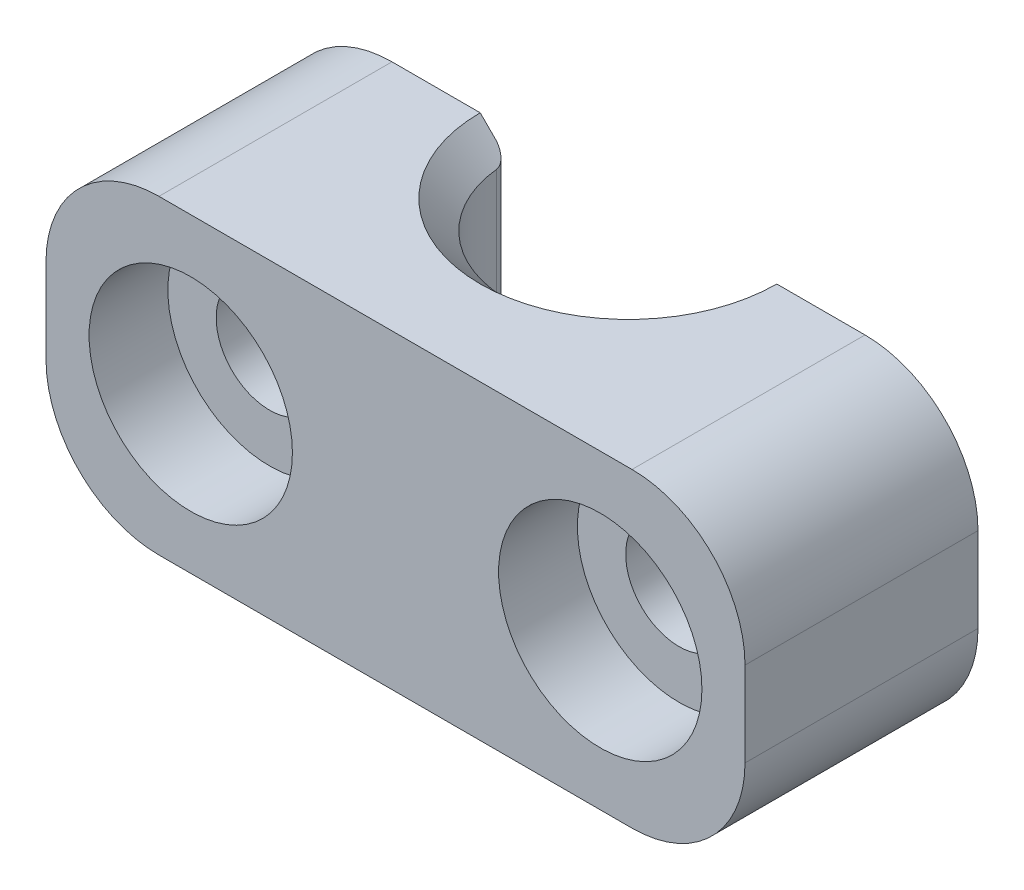
ISO-10303-21;
HEADER;
FILE_DESCRIPTION(('STEP AP214'),'2;1');
FILE_NAME('part.step','',(''),(''),'','','');
FILE_SCHEMA(('AUTOMOTIVE_DESIGN { 1 0 10303 214 1 1 1 1 }'));
ENDSEC;
DATA;
#1=APPLICATION_CONTEXT('core data for automotive mechanical design processes');
#2=APPLICATION_PROTOCOL_DEFINITION('international standard','automotive_design',2000,#1);
#3=PRODUCT_CONTEXT('',#1,'mechanical');
#4=PRODUCT('Part','Part','',(#3));
#5=PRODUCT_RELATED_PRODUCT_CATEGORY('part','',(#4));
#6=PRODUCT_DEFINITION_FORMATION('','',#4);
#7=PRODUCT_DEFINITION_CONTEXT('part definition',#1,'design');
#8=PRODUCT_DEFINITION('design','',#6,#7);
#9=PRODUCT_DEFINITION_SHAPE('','',#8);
#10=(LENGTH_UNIT() NAMED_UNIT(*) SI_UNIT(.MILLI.,.METRE.));
#11=(NAMED_UNIT(*) PLANE_ANGLE_UNIT() SI_UNIT($,.RADIAN.));
#12=(NAMED_UNIT(*) SI_UNIT($,.STERADIAN.) SOLID_ANGLE_UNIT());
#13=UNCERTAINTY_MEASURE_WITH_UNIT(LENGTH_MEASURE(1.E-05),#10,'distance_accuracy_value','');
#14=(GEOMETRIC_REPRESENTATION_CONTEXT(3) GLOBAL_UNCERTAINTY_ASSIGNED_CONTEXT((#13)) GLOBAL_UNIT_ASSIGNED_CONTEXT((#10,
#11,#12)) REPRESENTATION_CONTEXT('',''));
#15=CARTESIAN_POINT('',(0.,0.,0.));
#16=DIRECTION('',(0.,0.,1.));
#17=DIRECTION('',(1.,0.,0.));
#18=AXIS2_PLACEMENT_3D('',#15,#16,#17);
#19=CARTESIAN_POINT('',(0.,0.,0.));
#20=DIRECTION('',(0.,0.,-1.));
#21=DIRECTION('',(-1.,0.,0.));
#22=AXIS2_PLACEMENT_3D('',#19,#20,#21);
#23=PLANE('',#22);
#24=DIRECTION('',(-1.,0.,0.));
#25=VECTOR('',#24,1.);
#26=CARTESIAN_POINT('',(12.375,-5.50000000000001,0.));
#27=LINE('',#26,#25);
#28=CARTESIAN_POINT('',(-5.25000000003318,-5.50000000000001,0.));
#29=VERTEX_POINT('',#28);
#30=CARTESIAN_POINT('',(-8.375,-5.50000000000001,0.));
#31=VERTEX_POINT('',#30);
#32=EDGE_CURVE('E159',#29,#31,#27,.T.);
#33=ORIENTED_EDGE('',*,*,#32,.T.);
#34=CARTESIAN_POINT('',(-8.375,-1.50000000000001,0.));
#35=DIRECTION('',(0.,0.,-1.));
#36=DIRECTION('',(-1.,0.,0.));
#37=AXIS2_PLACEMENT_3D('',#34,#35,#36);
#38=CIRCLE('',#37,4.);
#39=CARTESIAN_POINT('',(-12.375,-1.50000000000001,0.));
#40=VERTEX_POINT('',#39);
#41=EDGE_CURVE('E362',#31,#40,#38,.T.);
#42=ORIENTED_EDGE('',*,*,#41,.T.);
#43=DIRECTION('',(0.,1.,0.));
#44=VECTOR('',#43,1.);
#45=CARTESIAN_POINT('',(-12.375,-5.50000000000001,0.));
#46=LINE('',#45,#44);
#47=CARTESIAN_POINT('',(-12.375,1.5,0.));
#48=VERTEX_POINT('',#47);
#49=EDGE_CURVE('E158',#40,#48,#46,.T.);
#50=ORIENTED_EDGE('',*,*,#49,.T.);
#51=CARTESIAN_POINT('',(-8.375,1.5,0.));
#52=DIRECTION('',(0.,0.,-1.));
#53=DIRECTION('',(-1.,0.,0.));
#54=AXIS2_PLACEMENT_3D('',#51,#52,#53);
#55=CIRCLE('',#54,4.);
#56=CARTESIAN_POINT('',(-8.375,5.5,0.));
#57=VERTEX_POINT('',#56);
#58=EDGE_CURVE('E61',#48,#57,#55,.T.);
#59=ORIENTED_EDGE('',*,*,#58,.T.);
#60=DIRECTION('',(1.,0.,0.));
#61=VECTOR('',#60,1.);
#62=CARTESIAN_POINT('',(-12.375,5.50000000000001,0.));
#63=LINE('',#62,#61);
#64=CARTESIAN_POINT('',(-5.2500000000332,5.5,0.));
#65=VERTEX_POINT('',#64);
#66=EDGE_CURVE('E327',#57,#65,#63,.T.);
#67=ORIENTED_EDGE('',*,*,#66,.T.);
#68=DIRECTION('',(-0.707106781186549,0.707106781186546,0.));
#69=VECTOR('',#68,1.);
#70=CARTESIAN_POINT('',(0.,0.249999999966837,0.));
#71=LINE('',#70,#69);
#72=CARTESIAN_POINT('',(-4.72361090692279,4.9736109068896,0.));
#73=VERTEX_POINT('',#72);
#74=EDGE_CURVE('E188',#65,#73,#71,.F.);
#75=ORIENTED_EDGE('',*,*,#74,.T.);
#76=DIRECTION('',(0.,-1.,0.));
#77=VECTOR('',#76,1.);
#78=CARTESIAN_POINT('',(-4.72361090692279,-4.49999999996681,0.));
#79=LINE('',#78,#77);
#80=CARTESIAN_POINT('',(-4.72361090692279,-4.97361090688961,0.));
#81=VERTEX_POINT('',#80);
#82=EDGE_CURVE('E234',#73,#81,#79,.T.);
#83=ORIENTED_EDGE('',*,*,#82,.T.);
#84=DIRECTION('',(0.707106781186546,0.707106781186549,0.));
#85=VECTOR('',#84,1.);
#86=CARTESIAN_POINT('',(0.,-0.249999999966797,0.));
#87=LINE('',#86,#85);
#88=EDGE_CURVE('E191',#81,#29,#87,.F.);
#89=ORIENTED_EDGE('',*,*,#88,.T.);
#90=EDGE_LOOP('',(#33,#42,#50,#59,#67,#75,#83,#89));
#91=FACE_BOUND('',#90,.T.);
#92=CARTESIAN_POINT('',(-7.25,0.,0.));
#93=DIRECTION('',(0.,0.,1.));
#94=DIRECTION('',(1.,0.,0.));
#95=AXIS2_PLACEMENT_3D('',#92,#93,#94);
#96=CIRCLE('',#95,1.89000000000001);
#97=CARTESIAN_POINT('',(-5.35999999999999,0.,0.));
#98=VERTEX_POINT('',#97);
#99=EDGE_CURVE('E298',#98,#98,#96,.T.);
#100=ORIENTED_EDGE('',*,*,#99,.T.);
#101=EDGE_LOOP('',(#100));
#102=FACE_BOUND('',#101,.T.);
#103=ADVANCED_FACE('F46',(#91,#102),#23,.T.);
#104=CARTESIAN_POINT('',(-12.375,5.50000000000001,8.25));
#105=DIRECTION('',(0.,1.,0.));
#106=DIRECTION('',(-1.,0.,0.));
#107=AXIS2_PLACEMENT_3D('',#104,#105,#106);
#108=PLANE('',#107);
#109=DIRECTION('',(1.,0.,0.));
#110=VECTOR('',#109,1.);
#111=CARTESIAN_POINT('',(-12.375,5.50000000000001,8.25));
#112=LINE('',#111,#110);
#113=CARTESIAN_POINT('',(-8.375,5.5,8.25));
#114=VERTEX_POINT('',#113);
#115=CARTESIAN_POINT('',(8.375,5.5,8.25));
#116=VERTEX_POINT('',#115);
#117=EDGE_CURVE('E319',#114,#116,#112,.T.);
#118=ORIENTED_EDGE('',*,*,#117,.T.);
#119=DIRECTION('',(0.,0.,-1.));
#120=VECTOR('',#119,1.);
#121=CARTESIAN_POINT('',(8.375,5.5,8.25));
#122=LINE('',#121,#120);
#123=CARTESIAN_POINT('',(8.375,5.5,0.));
#124=VERTEX_POINT('',#123);
#125=EDGE_CURVE('E13',#116,#124,#122,.T.);
#126=ORIENTED_EDGE('',*,*,#125,.T.);
#127=CARTESIAN_POINT('',(5.25000000003319,5.5,0.));
#128=VERTEX_POINT('',#127);
#129=EDGE_CURVE('E318',#128,#124,#63,.T.);
#130=ORIENTED_EDGE('',*,*,#129,.F.);
#131=CARTESIAN_POINT('',(0.,5.5,0.));
#132=DIRECTION('',(0.,1.,0.));
#133=DIRECTION('',(-1.,0.,0.));
#134=AXIS2_PLACEMENT_3D('',#131,#132,#133);
#135=CIRCLE('',#134,5.25000000003319);
#136=EDGE_CURVE('E193',#128,#65,#135,.F.);
#137=ORIENTED_EDGE('',*,*,#136,.T.);
#138=ORIENTED_EDGE('',*,*,#66,.F.);
#139=DIRECTION('',(0.,0.,-1.));
#140=VECTOR('',#139,1.);
#141=CARTESIAN_POINT('',(-8.375,5.5,8.25));
#142=LINE('',#141,#140);
#143=EDGE_CURVE('E54',#57,#114,#142,.F.);
#144=ORIENTED_EDGE('',*,*,#143,.T.);
#145=EDGE_LOOP('',(#118,#126,#130,#137,#138,#144));
#146=FACE_BOUND('',#145,.T.);
#147=ADVANCED_FACE('F243',(#146),#108,.T.);
#148=CARTESIAN_POINT('',(-12.375,-5.50000000000001,8.25));
#149=DIRECTION('',(-1.,0.,0.));
#150=DIRECTION('',(0.,0.,1.));
#151=AXIS2_PLACEMENT_3D('',#148,#149,#150);
#152=PLANE('',#151);
#153=ORIENTED_EDGE('',*,*,#49,.F.);
#154=DIRECTION('',(0.,0.,-1.));
#155=VECTOR('',#154,1.);
#156=CARTESIAN_POINT('',(-12.375,-1.50000000000001,8.25));
#157=LINE('',#156,#155);
#158=CARTESIAN_POINT('',(-12.375,-1.50000000000001,8.25));
#159=VERTEX_POINT('',#158);
#160=EDGE_CURVE('E366',#40,#159,#157,.F.);
#161=ORIENTED_EDGE('',*,*,#160,.T.);
#162=DIRECTION('',(0.,1.,0.));
#163=VECTOR('',#162,1.);
#164=CARTESIAN_POINT('',(-12.375,-5.50000000000001,8.25));
#165=LINE('',#164,#163);
#166=CARTESIAN_POINT('',(-12.375,1.5,8.25));
#167=VERTEX_POINT('',#166);
#168=EDGE_CURVE('E175',#159,#167,#165,.T.);
#169=ORIENTED_EDGE('',*,*,#168,.T.);
#170=DIRECTION('',(0.,0.,-1.));
#171=VECTOR('',#170,1.);
#172=CARTESIAN_POINT('',(-12.375,1.5,8.25));
#173=LINE('',#172,#171);
#174=EDGE_CURVE('E364',#167,#48,#173,.T.);
#175=ORIENTED_EDGE('',*,*,#174,.T.);
#176=EDGE_LOOP('',(#153,#161,#169,#175));
#177=FACE_BOUND('',#176,.T.);
#178=ADVANCED_FACE('F247',(#177),#152,.T.);
#179=CARTESIAN_POINT('',(12.375,-5.50000000000001,8.25));
#180=DIRECTION('',(0.,-1.,0.));
#181=DIRECTION('',(1.,0.,0.));
#182=AXIS2_PLACEMENT_3D('',#179,#180,#181);
#183=PLANE('',#182);
#184=CARTESIAN_POINT('',(8.375,-5.50000000000001,0.));
#185=VERTEX_POINT('',#184);
#186=CARTESIAN_POINT('',(5.25000000003318,-5.50000000000001,0.));
#187=VERTEX_POINT('',#186);
#188=EDGE_CURVE('E147',#185,#187,#27,.T.);
#189=ORIENTED_EDGE('',*,*,#188,.F.);
#190=DIRECTION('',(0.,0.,-1.));
#191=VECTOR('',#190,1.);
#192=CARTESIAN_POINT('',(8.375,-5.50000000000001,8.25));
#193=LINE('',#192,#191);
#194=CARTESIAN_POINT('',(8.375,-5.50000000000001,8.25));
#195=VERTEX_POINT('',#194);
#196=EDGE_CURVE('E352',#185,#195,#193,.F.);
#197=ORIENTED_EDGE('',*,*,#196,.T.);
#198=DIRECTION('',(-1.,0.,0.));
#199=VECTOR('',#198,1.);
#200=CARTESIAN_POINT('',(12.375,-5.50000000000001,8.25));
#201=LINE('',#200,#199);
#202=CARTESIAN_POINT('',(-8.375,-5.50000000000001,8.25));
#203=VERTEX_POINT('',#202);
#204=EDGE_CURVE('E179',#195,#203,#201,.T.);
#205=ORIENTED_EDGE('',*,*,#204,.T.);
#206=DIRECTION('',(0.,0.,-1.));
#207=VECTOR('',#206,1.);
#208=CARTESIAN_POINT('',(-8.375,-5.50000000000001,8.25));
#209=LINE('',#208,#207);
#210=EDGE_CURVE('E350',#203,#31,#209,.T.);
#211=ORIENTED_EDGE('',*,*,#210,.T.);
#212=ORIENTED_EDGE('',*,*,#32,.F.);
#213=CARTESIAN_POINT('',(0.,-5.50000000000001,0.));
#214=DIRECTION('',(0.,-1.,0.));
#215=DIRECTION('',(1.,0.,0.));
#216=AXIS2_PLACEMENT_3D('',#213,#214,#215);
#217=CIRCLE('',#216,5.25000000003318);
#218=EDGE_CURVE('E165',#29,#187,#217,.F.);
#219=ORIENTED_EDGE('',*,*,#218,.T.);
#220=EDGE_LOOP('',(#189,#197,#205,#211,#212,#219));
#221=FACE_BOUND('',#220,.T.);
#222=ADVANCED_FACE('F172',(#221),#183,.T.);
#223=CARTESIAN_POINT('',(12.375,5.5,8.25));
#224=DIRECTION('',(1.,0.,0.));
#225=DIRECTION('',(0.,0.,-1.));
#226=AXIS2_PLACEMENT_3D('',#223,#224,#225);
#227=PLANE('',#226);
#228=DIRECTION('',(0.,-1.,0.));
#229=VECTOR('',#228,1.);
#230=CARTESIAN_POINT('',(12.375,5.5,8.25));
#231=LINE('',#230,#229);
#232=CARTESIAN_POINT('',(12.375,1.5,8.25));
#233=VERTEX_POINT('',#232);
#234=CARTESIAN_POINT('',(12.375,-1.50000000000001,8.25));
#235=VERTEX_POINT('',#234);
#236=EDGE_CURVE('E322',#233,#235,#231,.T.);
#237=ORIENTED_EDGE('',*,*,#236,.T.);
#238=DIRECTION('',(0.,0.,-1.));
#239=VECTOR('',#238,1.);
#240=CARTESIAN_POINT('',(12.375,-1.50000000000001,8.25));
#241=LINE('',#240,#239);
#242=CARTESIAN_POINT('',(12.375,-1.50000000000001,0.));
#243=VERTEX_POINT('',#242);
#244=EDGE_CURVE('E338',#235,#243,#241,.T.);
#245=ORIENTED_EDGE('',*,*,#244,.T.);
#246=DIRECTION('',(0.,-1.,0.));
#247=VECTOR('',#246,1.);
#248=CARTESIAN_POINT('',(12.375,5.5,0.));
#249=LINE('',#248,#247);
#250=CARTESIAN_POINT('',(12.375,1.5,0.));
#251=VERTEX_POINT('',#250);
#252=EDGE_CURVE('E329',#251,#243,#249,.T.);
#253=ORIENTED_EDGE('',*,*,#252,.F.);
#254=DIRECTION('',(0.,0.,-1.));
#255=VECTOR('',#254,1.);
#256=CARTESIAN_POINT('',(12.375,1.5,8.25));
#257=LINE('',#256,#255);
#258=EDGE_CURVE('E335',#251,#233,#257,.F.);
#259=ORIENTED_EDGE('',*,*,#258,.T.);
#260=EDGE_LOOP('',(#237,#245,#253,#259));
#261=FACE_BOUND('',#260,.T.);
#262=ADVANCED_FACE('F249',(#261),#227,.T.);
#263=CARTESIAN_POINT('',(0.,0.,8.25));
#264=DIRECTION('',(0.,0.,-1.));
#265=DIRECTION('',(-1.,0.,0.));
#266=AXIS2_PLACEMENT_3D('',#263,#264,#265);
#267=PLANE('',#266);
#268=CARTESIAN_POINT('',(-7.25,0.,8.25));
#269=DIRECTION('',(0.,0.,1.));
#270=DIRECTION('',(1.,0.,0.));
#271=AXIS2_PLACEMENT_3D('',#268,#269,#270);
#272=CIRCLE('',#271,3.6);
#273=CARTESIAN_POINT('',(-3.65,0.,8.25));
#274=VERTEX_POINT('',#273);
#275=EDGE_CURVE('E536',#274,#274,#272,.T.);
#276=ORIENTED_EDGE('',*,*,#275,.F.);
#277=EDGE_LOOP('',(#276));
#278=FACE_BOUND('',#277,.T.);
#279=CARTESIAN_POINT('',(7.25,0.,8.25));
#280=DIRECTION('',(0.,0.,1.));
#281=DIRECTION('',(1.,0.,0.));
#282=AXIS2_PLACEMENT_3D('',#279,#280,#281);
#283=CIRCLE('',#282,3.59999999999999);
#284=CARTESIAN_POINT('',(10.85,0.,8.25));
#285=VERTEX_POINT('',#284);
#286=EDGE_CURVE('E299',#285,#285,#283,.T.);
#287=ORIENTED_EDGE('',*,*,#286,.F.);
#288=EDGE_LOOP('',(#287));
#289=FACE_BOUND('',#288,.T.);
#290=ORIENTED_EDGE('',*,*,#204,.F.);
#291=CARTESIAN_POINT('',(8.375,-1.50000000000001,8.25));
#292=DIRECTION('',(0.,0.,-1.));
#293=DIRECTION('',(-1.,0.,0.));
#294=AXIS2_PLACEMENT_3D('',#291,#292,#293);
#295=CIRCLE('',#294,4.);
#296=EDGE_CURVE('E359',#195,#235,#295,.F.);
#297=ORIENTED_EDGE('',*,*,#296,.T.);
#298=ORIENTED_EDGE('',*,*,#236,.F.);
#299=CARTESIAN_POINT('',(8.375,1.5,8.25));
#300=DIRECTION('',(0.,0.,-1.));
#301=DIRECTION('',(-1.,0.,0.));
#302=AXIS2_PLACEMENT_3D('',#299,#300,#301);
#303=CIRCLE('',#302,4.);
#304=EDGE_CURVE('E343',#233,#116,#303,.F.);
#305=ORIENTED_EDGE('',*,*,#304,.T.);
#306=ORIENTED_EDGE('',*,*,#117,.F.);
#307=CARTESIAN_POINT('',(-8.375,1.5,8.25));
#308=DIRECTION('',(0.,0.,-1.));
#309=DIRECTION('',(-1.,0.,0.));
#310=AXIS2_PLACEMENT_3D('',#307,#308,#309);
#311=CIRCLE('',#310,4.);
#312=EDGE_CURVE('E354',#114,#167,#311,.F.);
#313=ORIENTED_EDGE('',*,*,#312,.T.);
#314=ORIENTED_EDGE('',*,*,#168,.F.);
#315=CARTESIAN_POINT('',(-8.375,-1.50000000000001,8.25));
#316=DIRECTION('',(0.,0.,-1.));
#317=DIRECTION('',(-1.,0.,0.));
#318=AXIS2_PLACEMENT_3D('',#315,#316,#317);
#319=CIRCLE('',#318,4.);
#320=EDGE_CURVE('E357',#159,#203,#319,.F.);
#321=ORIENTED_EDGE('',*,*,#320,.T.);
#322=EDGE_LOOP('',(#290,#297,#298,#305,#306,#313,#314,#321));
#323=FACE_BOUND('',#322,.T.);
#324=ADVANCED_FACE('F252',(#278,#289,#323),#267,.F.);
#325=ORIENTED_EDGE('',*,*,#252,.T.);
#326=CARTESIAN_POINT('',(8.375,-1.50000000000001,0.));
#327=DIRECTION('',(0.,0.,-1.));
#328=DIRECTION('',(-1.,0.,0.));
#329=AXIS2_PLACEMENT_3D('',#326,#327,#328);
#330=CIRCLE('',#329,4.);
#331=EDGE_CURVE('E154',#243,#185,#330,.T.);
#332=ORIENTED_EDGE('',*,*,#331,.T.);
#333=ORIENTED_EDGE('',*,*,#188,.T.);
#334=DIRECTION('',(0.707106781186546,-0.707106781186549,0.));
#335=VECTOR('',#334,1.);
#336=CARTESIAN_POINT('',(0.,-0.249999999966797,0.));
#337=LINE('',#336,#335);
#338=CARTESIAN_POINT('',(4.72361090692278,-4.97361090688961,0.));
#339=VERTEX_POINT('',#338);
#340=EDGE_CURVE('E152',#187,#339,#337,.F.);
#341=ORIENTED_EDGE('',*,*,#340,.T.);
#342=DIRECTION('',(0.,-1.,0.));
#343=VECTOR('',#342,1.);
#344=CARTESIAN_POINT('',(4.72361090692278,4.4999999999668,0.));
#345=LINE('',#344,#343);
#346=CARTESIAN_POINT('',(4.72361090692278,4.9736109068896,0.));
#347=VERTEX_POINT('',#346);
#348=EDGE_CURVE('E344',#339,#347,#345,.F.);
#349=ORIENTED_EDGE('',*,*,#348,.T.);
#350=DIRECTION('',(-0.707106781186549,-0.707106781186546,0.));
#351=VECTOR('',#350,1.);
#352=CARTESIAN_POINT('',(0.,0.249999999966837,0.));
#353=LINE('',#352,#351);
#354=EDGE_CURVE('E169',#347,#128,#353,.F.);
#355=ORIENTED_EDGE('',*,*,#354,.T.);
#356=ORIENTED_EDGE('',*,*,#129,.T.);
#357=CARTESIAN_POINT('',(8.375,1.5,0.));
#358=DIRECTION('',(0.,0.,-1.));
#359=DIRECTION('',(-1.,0.,0.));
#360=AXIS2_PLACEMENT_3D('',#357,#358,#359);
#361=CIRCLE('',#360,4.);
#362=EDGE_CURVE('E332',#124,#251,#361,.T.);
#363=ORIENTED_EDGE('',*,*,#362,.T.);
#364=EDGE_LOOP('',(#325,#332,#333,#341,#349,#355,#356,#363));
#365=FACE_BOUND('',#364,.T.);
#366=CARTESIAN_POINT('',(7.25,0.,0.));
#367=DIRECTION('',(0.,0.,1.));
#368=DIRECTION('',(1.,0.,0.));
#369=AXIS2_PLACEMENT_3D('',#366,#367,#368);
#370=CIRCLE('',#369,1.89000000000001);
#371=CARTESIAN_POINT('',(9.14000000000001,0.,0.));
#372=VERTEX_POINT('',#371);
#373=EDGE_CURVE('E315',#372,#372,#370,.T.);
#374=ORIENTED_EDGE('',*,*,#373,.T.);
#375=EDGE_LOOP('',(#374));
#376=FACE_BOUND('',#375,.T.);
#377=ADVANCED_FACE('F150',(#365,#376),#23,.T.);
#378=CARTESIAN_POINT('',(7.25,0.,8.25));
#379=DIRECTION('',(0.,0.,1.));
#380=DIRECTION('',(1.,0.,0.));
#381=AXIS2_PLACEMENT_3D('',#378,#379,#380);
#382=CYLINDRICAL_SURFACE('',#381,1.89000000000001);
#383=ORIENTED_EDGE('',*,*,#373,.F.);
#384=EDGE_LOOP('',(#383));
#385=FACE_BOUND('',#384,.T.);
#386=CARTESIAN_POINT('',(7.25,0.,5.46));
#387=DIRECTION('',(0.,0.,1.));
#388=DIRECTION('',(1.,0.,0.));
#389=AXIS2_PLACEMENT_3D('',#386,#387,#388);
#390=CIRCLE('',#389,1.89000000000001);
#391=CARTESIAN_POINT('',(9.14000000000001,0.,5.46));
#392=VERTEX_POINT('',#391);
#393=EDGE_CURVE('E312',#392,#392,#390,.T.);
#394=ORIENTED_EDGE('',*,*,#393,.T.);
#395=EDGE_LOOP('',(#394));
#396=FACE_BOUND('',#395,.T.);
#397=ADVANCED_FACE('F261',(#385,#396),#382,.F.);
#398=CARTESIAN_POINT('',(9.14000000000001,0.,5.46));
#399=DIRECTION('',(0.,0.,-1.));
#400=DIRECTION('',(-1.,0.,0.));
#401=AXIS2_PLACEMENT_3D('',#398,#399,#400);
#402=PLANE('',#401);
#403=ORIENTED_EDGE('',*,*,#393,.F.);
#404=EDGE_LOOP('',(#403));
#405=FACE_BOUND('',#404,.T.);
#406=CARTESIAN_POINT('',(7.25,0.,5.46));
#407=DIRECTION('',(0.,0.,1.));
#408=DIRECTION('',(1.,0.,0.));
#409=AXIS2_PLACEMENT_3D('',#406,#407,#408);
#410=CIRCLE('',#409,3.59999999999999);
#411=CARTESIAN_POINT('',(10.85,0.,5.46));
#412=VERTEX_POINT('',#411);
#413=EDGE_CURVE('E303',#412,#412,#410,.T.);
#414=ORIENTED_EDGE('',*,*,#413,.T.);
#415=EDGE_LOOP('',(#414));
#416=FACE_BOUND('',#415,.T.);
#417=ADVANCED_FACE('F267',(#405,#416),#402,.F.);
#418=CARTESIAN_POINT('',(7.25,0.,8.25));
#419=DIRECTION('',(0.,0.,1.));
#420=DIRECTION('',(1.,0.,0.));
#421=AXIS2_PLACEMENT_3D('',#418,#419,#420);
#422=CYLINDRICAL_SURFACE('',#421,3.59999999999999);
#423=ORIENTED_EDGE('',*,*,#413,.F.);
#424=EDGE_LOOP('',(#423));
#425=FACE_BOUND('',#424,.T.);
#426=ORIENTED_EDGE('',*,*,#286,.T.);
#427=EDGE_LOOP('',(#426));
#428=FACE_BOUND('',#427,.T.);
#429=ADVANCED_FACE('F271',(#425,#428),#422,.F.);
#430=CARTESIAN_POINT('',(-7.25,0.,8.25));
#431=DIRECTION('',(0.,0.,1.));
#432=DIRECTION('',(1.,0.,0.));
#433=AXIS2_PLACEMENT_3D('',#430,#431,#432);
#434=CYLINDRICAL_SURFACE('',#433,1.89000000000001);
#435=ORIENTED_EDGE('',*,*,#99,.F.);
#436=EDGE_LOOP('',(#435));
#437=FACE_BOUND('',#436,.T.);
#438=CARTESIAN_POINT('',(-7.25,0.,5.46));
#439=DIRECTION('',(0.,0.,1.));
#440=DIRECTION('',(1.,0.,0.));
#441=AXIS2_PLACEMENT_3D('',#438,#439,#440);
#442=CIRCLE('',#441,1.89000000000001);
#443=CARTESIAN_POINT('',(-5.35999999999999,0.,5.46));
#444=VERTEX_POINT('',#443);
#445=EDGE_CURVE('E300',#444,#444,#442,.T.);
#446=ORIENTED_EDGE('',*,*,#445,.T.);
#447=EDGE_LOOP('',(#446));
#448=FACE_BOUND('',#447,.T.);
#449=ADVANCED_FACE('F275',(#437,#448),#434,.F.);
#450=CARTESIAN_POINT('',(-5.35999999999999,0.,5.46));
#451=DIRECTION('',(0.,0.,-1.));
#452=DIRECTION('',(-1.,0.,0.));
#453=AXIS2_PLACEMENT_3D('',#450,#451,#452);
#454=PLANE('',#453);
#455=ORIENTED_EDGE('',*,*,#445,.F.);
#456=EDGE_LOOP('',(#455));
#457=FACE_BOUND('',#456,.T.);
#458=CARTESIAN_POINT('',(-7.25,0.,5.46));
#459=DIRECTION('',(0.,0.,1.));
#460=DIRECTION('',(1.,0.,0.));
#461=AXIS2_PLACEMENT_3D('',#458,#459,#460);
#462=CIRCLE('',#461,3.6);
#463=CARTESIAN_POINT('',(-3.65,0.,5.46));
#464=VERTEX_POINT('',#463);
#465=EDGE_CURVE('E306',#464,#464,#462,.T.);
#466=ORIENTED_EDGE('',*,*,#465,.T.);
#467=EDGE_LOOP('',(#466));
#468=FACE_BOUND('',#467,.T.);
#469=ADVANCED_FACE('F279',(#457,#468),#454,.F.);
#470=CARTESIAN_POINT('',(-7.25,0.,8.25));
#471=DIRECTION('',(0.,0.,1.));
#472=DIRECTION('',(1.,0.,0.));
#473=AXIS2_PLACEMENT_3D('',#470,#471,#472);
#474=CYLINDRICAL_SURFACE('',#473,3.6);
#475=ORIENTED_EDGE('',*,*,#465,.F.);
#476=EDGE_LOOP('',(#475));
#477=FACE_BOUND('',#476,.T.);
#478=ORIENTED_EDGE('',*,*,#275,.T.);
#479=EDGE_LOOP('',(#478));
#480=FACE_BOUND('',#479,.T.);
#481=ADVANCED_FACE('F283',(#477,#480),#474,.F.);
#482=CARTESIAN_POINT('',(0.,5.5,0.));
#483=DIRECTION('',(0.,1.,0.));
#484=DIRECTION('',(0.,0.,1.));
#485=AXIS2_PLACEMENT_3D('',#482,#483,#484);
#486=CYLINDRICAL_SURFACE('',#485,4.24999999999999);
#487=CARTESIAN_POINT('',(0.,-4.49999999996681,0.));
#488=DIRECTION('',(0.,-1.,0.));
#489=DIRECTION('',(0.,0.,-1.));
#490=AXIS2_PLACEMENT_3D('',#487,#488,#489);
#491=CIRCLE('',#490,4.24999999999999);
#492=CARTESIAN_POINT('',(4.22638870619407,-4.49999999996681,0.447368421052631));
#493=VERTEX_POINT('',#492);
#494=CARTESIAN_POINT('',(-4.22638870619407,-4.49999999996681,0.447368421052631));
#495=VERTEX_POINT('',#494);
#496=EDGE_CURVE('E185',#493,#495,#491,.T.);
#497=ORIENTED_EDGE('',*,*,#496,.T.);
#498=DIRECTION('',(0.,1.,0.));
#499=VECTOR('',#498,1.);
#500=CARTESIAN_POINT('',(-4.22638870619407,5.5,0.447368421052631));
#501=LINE('',#500,#499);
#502=CARTESIAN_POINT('',(-4.22638870619407,4.4999999999668,0.447368421052631));
#503=VERTEX_POINT('',#502);
#504=EDGE_CURVE('E199',#495,#503,#501,.T.);
#505=ORIENTED_EDGE('',*,*,#504,.T.);
#506=CARTESIAN_POINT('',(0.,4.4999999999668,0.));
#507=DIRECTION('',(0.,1.,0.));
#508=DIRECTION('',(0.,0.,1.));
#509=AXIS2_PLACEMENT_3D('',#506,#507,#508);
#510=CIRCLE('',#509,4.24999999999999);
#511=CARTESIAN_POINT('',(4.22638870619407,4.4999999999668,0.447368421052631));
#512=VERTEX_POINT('',#511);
#513=EDGE_CURVE('E168',#503,#512,#510,.T.);
#514=ORIENTED_EDGE('',*,*,#513,.T.);
#515=DIRECTION('',(0.,1.,0.));
#516=VECTOR('',#515,1.);
#517=CARTESIAN_POINT('',(4.22638870619407,5.5,0.447368421052631));
#518=LINE('',#517,#516);
#519=EDGE_CURVE('E196',#512,#493,#518,.F.);
#520=ORIENTED_EDGE('',*,*,#519,.T.);
#521=EDGE_LOOP('',(#497,#505,#514,#520));
#522=FACE_BOUND('',#521,.T.);
#523=ADVANCED_FACE('F242',(#522),#486,.F.);
#524=CARTESIAN_POINT('',(0.,-5.50000000000001,0.));
#525=DIRECTION('',(0.,-1.,0.));
#526=DIRECTION('',(0.,0.,-1.));
#527=AXIS2_PLACEMENT_3D('',#524,#525,#526);
#528=CONICAL_SURFACE('',#527,5.25000000003318,0.785398163397446);
#529=ORIENTED_EDGE('',*,*,#88,.F.);
#530=CARTESIAN_POINT('',(-4.72361090692279,-4.97361090688961,0.));
#531=CARTESIAN_POINT('',(-4.70451559799697,-4.95451737792977,5.74578598498488E-06));
#532=CARTESIAN_POINT('',(-4.68541942708042,-4.93541951605333,0.00109428033940479));
#533=CARTESIAN_POINT('',(-4.64732207919542,-4.8973243046975,0.00548019882647968));
#534=CARTESIAN_POINT('',(-4.62832109708245,-4.87832715869337,0.00878102866187079));
#535=CARTESIAN_POINT('',(-4.59036928713761,-4.84040120969419,0.0176824178871104));
#536=CARTESIAN_POINT('',(-4.57142117166191,-4.82147531324672,0.0233072078518022));
#537=CARTESIAN_POINT('',(-4.53394967233196,-4.78409483708891,0.0369386143152173));
#538=CARTESIAN_POINT('',(-4.51542597755819,-4.76563991115127,0.0449434230035749));
#539=CARTESIAN_POINT('',(-4.47307241881882,-4.7235481427248,0.0664526714751249));
#540=CARTESIAN_POINT('',(-4.44945992491758,-4.7001616137765,0.080898294158464));
#541=CARTESIAN_POINT('',(-4.40390468806834,-4.65535969640405,0.114531237282875));
#542=CARTESIAN_POINT('',(-4.38195636847287,-4.63393766931531,0.133701714720097));
#543=CARTESIAN_POINT('',(-4.34613491009343,-4.59948158833207,0.171376197289017));
#544=CARTESIAN_POINT('',(-4.33167756683719,-4.58574113501358,0.188672762057519));
#545=CARTESIAN_POINT('',(-4.30462788036671,-4.56052177333043,0.226165166266373));
#546=CARTESIAN_POINT('',(-4.2920335647123,-4.54904046882509,0.246357894178167));
#547=CARTESIAN_POINT('',(-4.27178146513749,-4.53124247059607,0.285007620132869));
#548=CARTESIAN_POINT('',(-4.26364214288788,-4.52434781716947,0.302944037281931));
#549=CARTESIAN_POINT('',(-4.24938185173746,-4.51294338529187,0.34030052002936));
#550=CARTESIAN_POINT('',(-4.24325622081007,-4.50842808341296,0.359717028620896));
#551=CARTESIAN_POINT('',(-4.23557599097398,-4.50354015045773,0.390674928522668));
#552=CARTESIAN_POINT('',(-4.23320053968178,-4.50221814166536,0.401873352712115));
#553=CARTESIAN_POINT('',(-4.22921201522787,-4.50044601070973,0.424487006095318));
#554=CARTESIAN_POINT('',(-4.22759988679139,-4.49999696684745,0.435902485856072));
#555=CARTESIAN_POINT('',(-4.2263887061937,-4.49999999996638,0.447368421052472));
#556=B_SPLINE_CURVE_WITH_KNOTS('',3,(#530,#531,#532,#533,#534,#535,#536,#537,#538,#539,#540,
#541,#542,#543,#544,#545,#546,#547,#548,#549,#550,#551,#552,#553,#554,#555),.UNSPECIFIED.,.F.,
.F.,(4,2,2,2,2,2,2,2,2,2,2,2,4),(0.,0.0809946371767588,0.162115726824847,0.244104862375673,
0.326031879177829,0.434405373530558,0.542397991946375,0.621345897001138,0.700209610067577,
0.762575408956173,0.824795786862058,0.85931196268443,0.893870746446602),.UNSPECIFIED.);
#557=EDGE_CURVE('E233',#81,#495,#556,.T.);
#558=ORIENTED_EDGE('',*,*,#557,.T.);
#559=ORIENTED_EDGE('',*,*,#496,.F.);
#560=CARTESIAN_POINT('',(4.22638870619407,-4.49999999996681,0.447368421052631));
#561=CARTESIAN_POINT('',(4.22865137290567,-4.49995396282857,0.425625922930036));
#562=CARTESIAN_POINT('',(4.23240622727772,-4.50159926444922,0.404112162015551));
#563=CARTESIAN_POINT('',(4.24246424371683,-4.50786109558739,0.362364529279287));
#564=CARTESIAN_POINT('',(4.24874099289562,-4.51244711364019,0.342119831433334));
#565=CARTESIAN_POINT('',(4.26344222831816,-4.52417248707712,0.303334252733933));
#566=CARTESIAN_POINT('',(4.27185888457753,-4.53130257121672,0.284787488586978));
#567=CARTESIAN_POINT('',(4.29041733274829,-4.5476283916758,0.249518089586861));
#568=CARTESIAN_POINT('',(4.30056376671647,-4.55682970825019,0.232800567290096));
#569=CARTESIAN_POINT('',(4.32734176546488,-4.58161150182119,0.193784749292943));
#570=CARTESIAN_POINT('',(4.34475775809253,-4.59814099293177,0.172629351512955));
#571=CARTESIAN_POINT('',(4.38153021764735,-4.63354546679922,0.134366744057275));
#572=CARTESIAN_POINT('',(4.40089080432651,-4.65242545038238,0.117268398441175));
#573=CARTESIAN_POINT('',(4.44953219017115,-4.70019893635609,0.08026739276745));
#574=CARTESIAN_POINT('',(4.47949803370169,-4.72990653415996,0.0623219077147714));
#575=CARTESIAN_POINT('',(4.54094113638697,-4.79103969909765,0.0333238611405922));
#576=CARTESIAN_POINT('',(4.5724200610773,-4.82246716491418,0.0222790918446614));
#577=CARTESIAN_POINT('',(4.62401455808331,-4.87402209438028,0.0095983134657));
#578=CARTESIAN_POINT('',(4.64390814606928,-4.89391094191598,0.00598228700440294));
#579=CARTESIAN_POINT('',(4.68373701598429,-4.9337369748816,0.00119272611058303));
#580=CARTESIAN_POINT('',(4.70367156897721,-4.95367339764515,6.84018999686426E-06));
#581=CARTESIAN_POINT('',(4.72361090692278,-4.97361090688961,0.));
#582=B_SPLINE_CURVE_WITH_KNOTS('',3,(#560,#561,#562,#563,#564,#565,#566,#567,#568,#569,#570,
#571,#572,#573,#574,#575,#576,#577,#578,#579,#580,#581),.UNSPECIFIED.,.F.,.F.,(4,2,2,2,2,2,2,2,
2,2,4),(0.,0.0653570262004379,0.130046676361992,0.194502948671287,0.259135001011082,
0.354604057209093,0.450279817110325,0.58710858187134,0.724091574509869,0.809081061024956,
0.893637495733797),.UNSPECIFIED.);
#583=EDGE_CURVE('E167',#493,#339,#582,.T.);
#584=ORIENTED_EDGE('',*,*,#583,.T.);
#585=ORIENTED_EDGE('',*,*,#340,.F.);
#586=ORIENTED_EDGE('',*,*,#218,.F.);
#587=EDGE_LOOP('',(#529,#558,#559,#584,#585,#586));
#588=FACE_BOUND('',#587,.T.);
#589=ADVANCED_FACE('F164',(#588),#528,.F.);
#590=CARTESIAN_POINT('',(0.,4.4999999999668,0.));
#591=DIRECTION('',(0.,1.,0.));
#592=DIRECTION('',(0.,0.,1.));
#593=AXIS2_PLACEMENT_3D('',#590,#591,#592);
#594=CONICAL_SURFACE('',#593,4.24999999999999,0.785398163397451);
#595=ORIENTED_EDGE('',*,*,#513,.F.);
#596=CARTESIAN_POINT('',(-4.22638870619407,4.4999999999668,0.447368421052631));
#597=CARTESIAN_POINT('',(-4.22865137290568,4.49995396282856,0.425625922930036));
#598=CARTESIAN_POINT('',(-4.23240622727773,4.50159926444922,0.404112162015551));
#599=CARTESIAN_POINT('',(-4.24246424371684,4.50786109558738,0.362364529279287));
#600=CARTESIAN_POINT('',(-4.24874099289562,4.51244711364019,0.342119831433334));
#601=CARTESIAN_POINT('',(-4.26344222831816,4.52417248707711,0.303334252733932));
#602=CARTESIAN_POINT('',(-4.27185888457754,4.53130257121671,0.284787488586978));
#603=CARTESIAN_POINT('',(-4.2904173327483,4.54762839167579,0.24951808958686));
#604=CARTESIAN_POINT('',(-4.30056376671647,4.55682970825019,0.232800567290095));
#605=CARTESIAN_POINT('',(-4.32734176546489,4.58161150182118,0.193784749292942));
#606=CARTESIAN_POINT('',(-4.34475775809253,4.59814099293176,0.172629351512955));
#607=CARTESIAN_POINT('',(-4.38153021764736,4.63354546679921,0.134366744057274));
#608=CARTESIAN_POINT('',(-4.40089080432652,4.65242545038238,0.117268398441174));
#609=CARTESIAN_POINT('',(-4.44953219017116,4.70019893635609,0.0802673927674488));
#610=CARTESIAN_POINT('',(-4.4794980337017,4.72990653415995,0.0623219077147705));
#611=CARTESIAN_POINT('',(-4.54094113638698,4.79103969909764,0.0333238611405916));
#612=CARTESIAN_POINT('',(-4.57242006107731,4.82246716491418,0.0222790918446608));
#613=CARTESIAN_POINT('',(-4.62401455808332,4.87402209438027,0.00959831346569964));
#614=CARTESIAN_POINT('',(-4.64390814606929,4.89391094191598,0.00598228700440273));
#615=CARTESIAN_POINT('',(-4.6837370159843,4.9337369748816,0.00119272611058309));
#616=CARTESIAN_POINT('',(-4.70367156897721,4.95367339764514,6.84018999698651E-06));
#617=CARTESIAN_POINT('',(-4.72361090692279,4.9736109068896,0.));
#618=B_SPLINE_CURVE_WITH_KNOTS('',3,(#596,#597,#598,#599,#600,#601,#602,#603,#604,#605,#606,
#607,#608,#609,#610,#611,#612,#613,#614,#615,#616,#617),.UNSPECIFIED.,.F.,.F.,(4,2,2,2,2,2,2,2,
2,2,4),(0.,0.0653570262004381,0.130046676361993,0.194502948671287,0.259135001011082,
0.354604057209094,0.450279817110327,0.587108581871341,0.724091574509869,0.809081061024957,
0.893637495733794),.UNSPECIFIED.);
#619=EDGE_CURVE('E209',#503,#73,#618,.T.);
#620=ORIENTED_EDGE('',*,*,#619,.T.);
#621=ORIENTED_EDGE('',*,*,#74,.F.);
#622=ORIENTED_EDGE('',*,*,#136,.F.);
#623=ORIENTED_EDGE('',*,*,#354,.F.);
#624=CARTESIAN_POINT('',(4.72361090692278,4.9736109068896,0.));
#625=CARTESIAN_POINT('',(4.70451559799696,4.95451737792976,5.74578598494133E-06));
#626=CARTESIAN_POINT('',(4.68541942708041,4.93541951605332,0.00109428033940475));
#627=CARTESIAN_POINT('',(4.64732207919542,4.89732430469749,0.00548019882647962));
#628=CARTESIAN_POINT('',(4.62832109708244,4.87832715869336,0.00878102866187073));
#629=CARTESIAN_POINT('',(4.59036928713761,4.84040120969418,0.0176824178871102));
#630=CARTESIAN_POINT('',(4.57142117166191,4.82147531324671,0.0233072078518019));
#631=CARTESIAN_POINT('',(4.53394967233196,4.7840948370889,0.0369386143152166));
#632=CARTESIAN_POINT('',(4.51542597755819,4.76563991115126,0.0449434230035741));
#633=CARTESIAN_POINT('',(4.47307241881882,4.72354814272479,0.0664526714751238));
#634=CARTESIAN_POINT('',(4.44945992491758,4.7001616137765,0.080898294158463));
#635=CARTESIAN_POINT('',(4.40390468806833,4.65535969640405,0.114531237282873));
#636=CARTESIAN_POINT('',(4.38195636847286,4.6339376693153,0.133701714720095));
#637=CARTESIAN_POINT('',(4.34613491009342,4.59948158833207,0.171376197289015));
#638=CARTESIAN_POINT('',(4.33167756683719,4.58574113501357,0.188672762057517));
#639=CARTESIAN_POINT('',(4.3046278803667,4.56052177333043,0.226165166266371));
#640=CARTESIAN_POINT('',(4.2920335647123,4.54904046882508,0.246357894178165));
#641=CARTESIAN_POINT('',(4.27178146513748,4.53124247059607,0.285007620132867));
#642=CARTESIAN_POINT('',(4.26364214288788,4.52434781716946,0.302944037281929));
#643=CARTESIAN_POINT('',(4.24938185173745,4.51294338529186,0.340300520029359));
#644=CARTESIAN_POINT('',(4.24325622081007,4.50842808341296,0.359717028620895));
#645=CARTESIAN_POINT('',(4.23557599097397,4.50354015045772,0.390674928522667));
#646=CARTESIAN_POINT('',(4.23320053968178,4.50221814166535,0.401873352712115));
#647=CARTESIAN_POINT('',(4.22921201522787,4.50044601070972,0.424487006095318));
#648=CARTESIAN_POINT('',(4.22759988679139,4.49999696684744,0.435902485856072));
#649=CARTESIAN_POINT('',(4.2263887061937,4.49999999996637,0.447368421052472));
#650=B_SPLINE_CURVE_WITH_KNOTS('',3,(#624,#625,#626,#627,#628,#629,#630,#631,#632,#633,#634,
#635,#636,#637,#638,#639,#640,#641,#642,#643,#644,#645,#646,#647,#648,#649),.UNSPECIFIED.,.F.,
.F.,(4,2,2,2,2,2,2,2,2,2,2,2,4),(0.,0.0809946371767576,0.162115726824845,0.24410486237567,
0.326031879177826,0.434405373530552,0.542397991946369,0.621345897001133,0.700209610067572,
0.762575408956169,0.824795786862055,0.859311962684427,0.8938707464466),.UNSPECIFIED.);
#651=EDGE_CURVE('E202',#347,#512,#650,.T.);
#652=ORIENTED_EDGE('',*,*,#651,.T.);
#653=EDGE_LOOP('',(#595,#620,#621,#622,#623,#652));
#654=FACE_BOUND('',#653,.T.);
#655=ADVANCED_FACE('F215',(#654),#594,.F.);
#656=CARTESIAN_POINT('',(-4.72361090692279,5.5,0.5));
#657=DIRECTION('',(0.,1.,0.));
#658=DIRECTION('',(0.,0.,1.));
#659=AXIS2_PLACEMENT_3D('',#656,#657,#658);
#660=CYLINDRICAL_SURFACE('',#659,0.5);
#661=ORIENTED_EDGE('',*,*,#557,.F.);
#662=ORIENTED_EDGE('',*,*,#82,.F.);
#663=ORIENTED_EDGE('',*,*,#619,.F.);
#664=ORIENTED_EDGE('',*,*,#504,.F.);
#665=EDGE_LOOP('',(#661,#662,#663,#664));
#666=FACE_BOUND('',#665,.T.);
#667=ADVANCED_FACE('F223',(#666),#660,.T.);
#668=CARTESIAN_POINT('',(4.72361090692278,5.5,0.5));
#669=DIRECTION('',(0.,1.,0.));
#670=DIRECTION('',(0.,0.,1.));
#671=AXIS2_PLACEMENT_3D('',#668,#669,#670);
#672=CYLINDRICAL_SURFACE('',#671,0.5);
#673=ORIENTED_EDGE('',*,*,#651,.F.);
#674=ORIENTED_EDGE('',*,*,#348,.F.);
#675=ORIENTED_EDGE('',*,*,#583,.F.);
#676=ORIENTED_EDGE('',*,*,#519,.F.);
#677=EDGE_LOOP('',(#673,#674,#675,#676));
#678=FACE_BOUND('',#677,.T.);
#679=ADVANCED_FACE('F218',(#678),#672,.T.);
#680=CARTESIAN_POINT('',(8.375,-1.50000000000001,8.25));
#681=DIRECTION('',(0.,0.,-1.));
#682=DIRECTION('',(-1.,0.,0.));
#683=AXIS2_PLACEMENT_3D('',#680,#681,#682);
#684=CYLINDRICAL_SURFACE('',#683,4.);
#685=ORIENTED_EDGE('',*,*,#296,.F.);
#686=ORIENTED_EDGE('',*,*,#196,.F.);
#687=ORIENTED_EDGE('',*,*,#331,.F.);
#688=ORIENTED_EDGE('',*,*,#244,.F.);
#689=EDGE_LOOP('',(#685,#686,#687,#688));
#690=FACE_BOUND('',#689,.T.);
#691=ADVANCED_FACE('F222',(#690),#684,.T.);
#692=CARTESIAN_POINT('',(-8.375,-1.50000000000001,8.25));
#693=DIRECTION('',(0.,0.,-1.));
#694=DIRECTION('',(-1.,0.,0.));
#695=AXIS2_PLACEMENT_3D('',#692,#693,#694);
#696=CYLINDRICAL_SURFACE('',#695,4.);
#697=ORIENTED_EDGE('',*,*,#320,.F.);
#698=ORIENTED_EDGE('',*,*,#160,.F.);
#699=ORIENTED_EDGE('',*,*,#41,.F.);
#700=ORIENTED_EDGE('',*,*,#210,.F.);
#701=EDGE_LOOP('',(#697,#698,#699,#700));
#702=FACE_BOUND('',#701,.T.);
#703=ADVANCED_FACE('F377',(#702),#696,.T.);
#704=CARTESIAN_POINT('',(8.375,1.5,8.25));
#705=DIRECTION('',(0.,0.,-1.));
#706=DIRECTION('',(-1.,0.,0.));
#707=AXIS2_PLACEMENT_3D('',#704,#705,#706);
#708=CYLINDRICAL_SURFACE('',#707,4.);
#709=ORIENTED_EDGE('',*,*,#304,.F.);
#710=ORIENTED_EDGE('',*,*,#258,.F.);
#711=ORIENTED_EDGE('',*,*,#362,.F.);
#712=ORIENTED_EDGE('',*,*,#125,.F.);
#713=EDGE_LOOP('',(#709,#710,#711,#712));
#714=FACE_BOUND('',#713,.T.);
#715=ADVANCED_FACE('F341',(#714),#708,.T.);
#716=CARTESIAN_POINT('',(-8.375,1.5,8.25));
#717=DIRECTION('',(0.,0.,-1.));
#718=DIRECTION('',(-1.,0.,0.));
#719=AXIS2_PLACEMENT_3D('',#716,#717,#718);
#720=CYLINDRICAL_SURFACE('',#719,4.);
#721=ORIENTED_EDGE('',*,*,#312,.F.);
#722=ORIENTED_EDGE('',*,*,#143,.F.);
#723=ORIENTED_EDGE('',*,*,#58,.F.);
#724=ORIENTED_EDGE('',*,*,#174,.F.);
#725=EDGE_LOOP('',(#721,#722,#723,#724));
#726=FACE_BOUND('',#725,.T.);
#727=ADVANCED_FACE('F48',(#726),#720,.T.);
#728=CLOSED_SHELL('',(#103,#147,#178,#222,#262,#324,#377,#397,#417,#429,#449,#469,#481,#523,
#589,#655,#667,#679,#691,#703,#715,#727));
#729=MANIFOLD_SOLID_BREP('B2',#728);
#730=ADVANCED_BREP_SHAPE_REPRESENTATION('',(#18,#729),#14);
#731=SHAPE_DEFINITION_REPRESENTATION(#9,#730);
ENDSEC;
END-ISO-10303-21;
